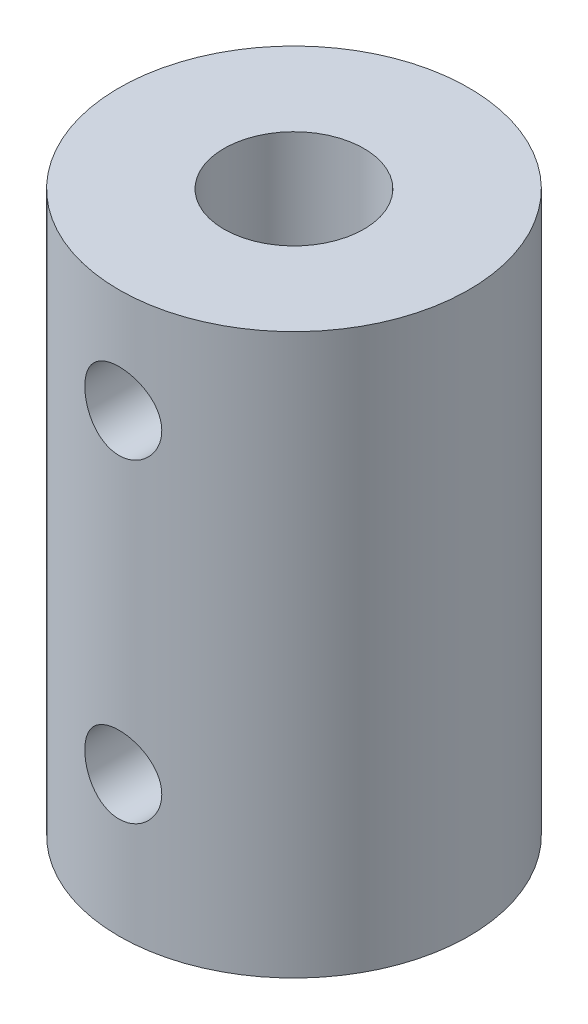
ISO-10303-21;
HEADER;
FILE_DESCRIPTION(('STEP AP214'),'2;1');
FILE_NAME('part.step','',(''),(''),'','','');
FILE_SCHEMA(('AUTOMOTIVE_DESIGN { 1 0 10303 214 1 1 1 1 }'));
ENDSEC;
DATA;
#1=APPLICATION_CONTEXT('core data for automotive mechanical design processes');
#2=APPLICATION_PROTOCOL_DEFINITION('international standard','automotive_design',2000,#1);
#3=PRODUCT_CONTEXT('',#1,'mechanical');
#4=PRODUCT('Part','Part','',(#3));
#5=PRODUCT_RELATED_PRODUCT_CATEGORY('part','',(#4));
#6=PRODUCT_DEFINITION_FORMATION('','',#4);
#7=PRODUCT_DEFINITION_CONTEXT('part definition',#1,'design');
#8=PRODUCT_DEFINITION('design','',#6,#7);
#9=PRODUCT_DEFINITION_SHAPE('','',#8);
#10=(LENGTH_UNIT() NAMED_UNIT(*) SI_UNIT(.MILLI.,.METRE.));
#11=(NAMED_UNIT(*) PLANE_ANGLE_UNIT() SI_UNIT($,.RADIAN.));
#12=(NAMED_UNIT(*) SI_UNIT($,.STERADIAN.) SOLID_ANGLE_UNIT());
#13=UNCERTAINTY_MEASURE_WITH_UNIT(LENGTH_MEASURE(1.E-05),#10,'distance_accuracy_value','');
#14=(GEOMETRIC_REPRESENTATION_CONTEXT(3) GLOBAL_UNCERTAINTY_ASSIGNED_CONTEXT((#13)) GLOBAL_UNIT_ASSIGNED_CONTEXT((#10,
#11,#12)) REPRESENTATION_CONTEXT('',''));
#15=CARTESIAN_POINT('',(0.,0.,0.));
#16=DIRECTION('',(0.,0.,1.));
#17=DIRECTION('',(1.,0.,0.));
#18=AXIS2_PLACEMENT_3D('',#15,#16,#17);
#19=CARTESIAN_POINT('',(0.,-24.,0.));
#20=DIRECTION('',(0.,1.,0.));
#21=DIRECTION('',(0.,0.,1.));
#22=AXIS2_PLACEMENT_3D('',#19,#20,#21);
#23=CYLINDRICAL_SURFACE('',#22,7.5);
#24=CARTESIAN_POINT('',(0.,-6.14999999999999,7.5));
#25=CARTESIAN_POINT('',(0.0914999393408011,-6.14999689388329,7.49999831424106));
#26=CARTESIAN_POINT('',(0.183037296855732,-6.14236318106865,7.49830854961464));
#27=CARTESIAN_POINT('',(0.363511023320149,-6.11206225940867,7.49173097533343));
#28=CARTESIAN_POINT('',(0.452445501715037,-6.08938439323356,7.48684089859969));
#29=CARTESIAN_POINT('',(0.625079242768202,-6.0297405539692,7.47440705823353));
#30=CARTESIAN_POINT('',(0.708783898837724,-5.99278959273429,7.46686608345357));
#31=CARTESIAN_POINT('',(0.868802700314479,-5.90569630891618,7.4499439147352));
#32=CARTESIAN_POINT('',(0.945117019602317,-5.85555429679658,7.44056276410836));
#33=CARTESIAN_POINT('',(1.08942970934261,-5.74264148918915,7.42081741826453));
#34=CARTESIAN_POINT('',(1.15729102940931,-5.67969766887048,7.41044091267737));
#35=CARTESIAN_POINT('',(1.28158292851941,-5.54333940178754,7.38996090019822));
#36=CARTESIAN_POINT('',(1.33801247885255,-5.46992401373074,7.3798574179456));
#37=CARTESIAN_POINT('',(1.43844520787671,-5.31369134292981,7.36094592663126));
#38=CARTESIAN_POINT('',(1.48230220287272,-5.2307780079661,7.35215368644803));
#39=CARTESIAN_POINT('',(1.55540709540188,-5.0585327458251,7.33703697303094));
#40=CARTESIAN_POINT('',(1.58465676165372,-4.96920159724356,7.33071220104563));
#41=CARTESIAN_POINT('',(1.62726320761459,-4.78814395939664,7.3213719537811));
#42=CARTESIAN_POINT('',(1.64086278535652,-4.69647726630274,7.31830597985859));
#43=CARTESIAN_POINT('',(1.65253801366901,-4.51211606415167,7.31567882302511));
#44=CARTESIAN_POINT('',(1.6506155954628,-4.41942168439077,7.31611720410754));
#45=CARTESIAN_POINT('',(1.6314967280213,-4.23744348167057,7.32040352024315));
#46=CARTESIAN_POINT('',(1.61458260643201,-4.14812828725854,7.32418842940723));
#47=CARTESIAN_POINT('',(1.5664078726783,-3.97363508632754,7.33464165989446));
#48=CARTESIAN_POINT('',(1.53514644719315,-3.88845731465377,7.34131014468067));
#49=CARTESIAN_POINT('',(1.45890598688934,-3.72386456484734,7.35684109933612));
#50=CARTESIAN_POINT('',(1.41381862824297,-3.64450145530904,7.36572078647476));
#51=CARTESIAN_POINT('',(1.3112823169619,-3.49436318177397,7.3846631014116));
#52=CARTESIAN_POINT('',(1.25383166066753,-3.42358920346177,7.39472589215443));
#53=CARTESIAN_POINT('',(1.12670629880249,-3.29101303710661,7.41517081765931));
#54=CARTESIAN_POINT('',(1.05679158832993,-3.22944109133507,7.42555512168707));
#55=CARTESIAN_POINT('',(0.907510905058955,-3.11885837608795,7.44527255252899));
#56=CARTESIAN_POINT('',(0.82814475719804,-3.06984783933175,7.45460565986633));
#57=CARTESIAN_POINT('',(0.661931267895289,-2.98572123553566,7.4711999610659));
#58=CARTESIAN_POINT('',(0.575068033653585,-2.95063561420552,7.47845660535503));
#59=CARTESIAN_POINT('',(0.396483640858848,-2.89562258522819,7.49004657125319));
#60=CARTESIAN_POINT('',(0.304763199289835,-2.87569294700434,7.49438032302729));
#61=CARTESIAN_POINT('',(0.121042700683247,-2.85189313774669,7.49957488574714));
#62=CARTESIAN_POINT('',(0.0290852501339717,-2.84770849163739,7.50050369388944));
#63=CARTESIAN_POINT('',(-0.154214783533879,-2.85466469502872,7.49897438369855));
#64=CARTESIAN_POINT('',(-0.245557408436373,-2.8658044922846,7.49651649791089));
#65=CARTESIAN_POINT('',(-0.423991007748931,-2.90283265132216,7.48853291011624));
#66=CARTESIAN_POINT('',(-0.511117938303425,-2.92855581582791,7.48304158779087));
#67=CARTESIAN_POINT('',(-0.679820246095632,-2.99383695756339,7.46960587824172));
#68=CARTESIAN_POINT('',(-0.761395145868541,-3.0333961228733,7.46166128036508));
#69=CARTESIAN_POINT('',(-0.917976261781451,-3.12587978321852,7.44403270371493));
#70=CARTESIAN_POINT('',(-0.992870859505148,-3.1789886922759,7.43432530594193));
#71=CARTESIAN_POINT('',(-1.13279771208182,-3.29682171018652,7.41429527403409));
#72=CARTESIAN_POINT('',(-1.19782866797858,-3.36154734641593,7.40397255911623));
#73=CARTESIAN_POINT('',(-1.3174275998863,-3.50222027859977,7.38364007713336));
#74=CARTESIAN_POINT('',(-1.37177769648958,-3.5783544312955,7.373639743821));
#75=CARTESIAN_POINT('',(-1.46692164784539,-3.73885442521818,7.35530407569124));
#76=CARTESIAN_POINT('',(-1.50771609134851,-3.82321990873516,7.34696866856884));
#77=CARTESIAN_POINT('',(-1.57431369753846,-3.99733416930289,7.33298679212086));
#78=CARTESIAN_POINT('',(-1.60020149826091,-4.08704929627586,7.32732517503717));
#79=CARTESIAN_POINT('',(-1.63649815552641,-4.26969698070692,7.31930499643681));
#80=CARTESIAN_POINT('',(-1.64690952060538,-4.3626290142455,7.3169458996267));
#81=CARTESIAN_POINT('',(-1.65185003885159,-4.5468749692852,7.31583187657225));
#82=CARTESIAN_POINT('',(-1.64672474541726,-4.63817931994234,7.3169985317166));
#83=CARTESIAN_POINT('',(-1.62151064971411,-4.81858911375489,7.32262705863688));
#84=CARTESIAN_POINT('',(-1.60142202805462,-4.90769458343767,7.32708889063959));
#85=CARTESIAN_POINT('',(-1.54701934318005,-5.08089887364454,7.33876659051329));
#86=CARTESIAN_POINT('',(-1.51275612845809,-5.16501437374034,7.34597260690617));
#87=CARTESIAN_POINT('',(-1.43102033898959,-5.32635416226081,7.36233049430586));
#88=CARTESIAN_POINT('',(-1.38354636957811,-5.40357772196298,7.37148257073497));
#89=CARTESIAN_POINT('',(-1.27559296460682,-5.55064370885943,7.3909352154142));
#90=CARTESIAN_POINT('',(-1.21486750796967,-5.62030297965252,7.40125543681466));
#91=CARTESIAN_POINT('',(-1.08263275210778,-5.7485559345428,7.42175007997792));
#92=CARTESIAN_POINT('',(-1.01112096165039,-5.80714705525867,7.43192446746263));
#93=CARTESIAN_POINT('',(-0.858209468643986,-5.91233915166255,7.45113988726204));
#94=CARTESIAN_POINT('',(-0.776692042971303,-5.95877221861649,7.46016424553825));
#95=CARTESIAN_POINT('',(-0.606827789468277,-6.03720389832133,7.47589523887679));
#96=CARTESIAN_POINT('',(-0.518486730197528,-6.06921455037322,7.48260380597825));
#97=CARTESIAN_POINT('',(-0.358388456603651,-6.11222376891093,7.49175811514749));
#98=CARTESIAN_POINT('',(-0.287493809384324,-6.12636269380082,7.4948296001288));
#99=CARTESIAN_POINT('',(-0.144407171386655,-6.14525182243697,7.49895116200565));
#100=CARTESIAN_POINT('',(-0.0722152395237916,-6.15000245146568,7.5000013304652));
#101=CARTESIAN_POINT('',(0.,-6.14999999999999,7.5));
#102=B_SPLINE_CURVE_WITH_KNOTS('',3,(#24,#25,#26,#27,#28,#29,#30,#31,#32,#33,#34,#35,#36,#37,
#38,#39,#40,#41,#42,#43,#44,#45,#46,#47,#48,#49,#50,#51,#52,#53,#54,#55,#56,#57,#58,#59,#60,#61,
#62,#63,#64,#65,#66,#67,#68,#69,#70,#71,#72,#73,#74,#75,#76,#77,#78,#79,#80,#81,#82,#83,#84,#85,
#86,#87,#88,#89,#90,#91,#92,#93,#94,#95,#96,#97,#98,#99,#100,#101),.UNSPECIFIED.,.T.,.F.,(4,2,2,
2,2,2,2,2,2,2,2,2,2,2,2,2,2,2,2,2,2,2,2,2,2,2,2,2,2,2,2,2,2,2,2,2,2,2,4),(0.,0.274235469748509,
0.548665416592522,0.822807511778603,1.09694315535338,1.37506480293447,1.65321146673233,
1.93447194708654,2.21569836294015,2.49250033112996,2.76926786056845,3.04093142111883,
3.31261038365022,3.58647477653389,3.86037693206285,4.14027337309168,4.42017499925701,
4.70068528026744,4.98115426927861,5.25599076583744,5.53080839183635,5.80257342230781,
6.07436179463611,6.35006739343502,6.62580926880842,6.90669641720308,7.1875713644818,
7.46683540152297,7.74605416843228,8.01910869065847,8.29215991713438,8.56424000622431,
8.83634882982829,9.11402013989234,9.39175567994315,9.67314563039329,9.95430024968245,
10.1707471396203,10.3871842244587),.UNSPECIFIED.);
#103=CARTESIAN_POINT('',(0.,-6.14999999999999,7.5));
#104=VERTEX_POINT('',#103);
#105=EDGE_CURVE('E108',#104,#104,#102,.T.);
#106=ORIENTED_EDGE('',*,*,#105,.F.);
#107=EDGE_LOOP('',(#106));
#108=FACE_BOUND('',#107,.T.);
#109=CARTESIAN_POINT('',(0.,-19.65,7.5));
#110=CARTESIAN_POINT('',(0.0914999393408012,-19.6499968938833,7.49999831424106));
#111=CARTESIAN_POINT('',(0.183037296855732,-19.6423631810687,7.49830854961464));
#112=CARTESIAN_POINT('',(0.363511023320149,-19.6120622594087,7.49173097533343));
#113=CARTESIAN_POINT('',(0.452445501715037,-19.5893843932336,7.48684089859969));
#114=CARTESIAN_POINT('',(0.625079242768202,-19.5297405539692,7.47440705823353));
#115=CARTESIAN_POINT('',(0.708783898837724,-19.4927895927343,7.46686608345357));
#116=CARTESIAN_POINT('',(0.868802700314479,-19.4056963089162,7.4499439147352));
#117=CARTESIAN_POINT('',(0.945117019602317,-19.3555542967966,7.44056276410836));
#118=CARTESIAN_POINT('',(1.08942970934261,-19.2426414891892,7.42081741826453));
#119=CARTESIAN_POINT('',(1.15729102940931,-19.1796976688705,7.41044091267737));
#120=CARTESIAN_POINT('',(1.28158292851941,-19.0433394017875,7.38996090019822));
#121=CARTESIAN_POINT('',(1.33801247885254,-18.9699240137307,7.3798574179456));
#122=CARTESIAN_POINT('',(1.43844520787671,-18.8136913429298,7.36094592663126));
#123=CARTESIAN_POINT('',(1.48230220287272,-18.7307780079661,7.35215368644803));
#124=CARTESIAN_POINT('',(1.55540709540188,-18.5585327458251,7.33703697303094));
#125=CARTESIAN_POINT('',(1.58465676165372,-18.4692015972436,7.33071220104563));
#126=CARTESIAN_POINT('',(1.62726320761459,-18.2881439593966,7.3213719537811));
#127=CARTESIAN_POINT('',(1.64086278535652,-18.1964772663028,7.31830597985859));
#128=CARTESIAN_POINT('',(1.65253801366901,-18.0121160641517,7.31567882302511));
#129=CARTESIAN_POINT('',(1.6506155954628,-17.9194216843908,7.31611720410754));
#130=CARTESIAN_POINT('',(1.6314967280213,-17.7374434816706,7.32040352024315));
#131=CARTESIAN_POINT('',(1.61458260643201,-17.6481282872585,7.32418842940723));
#132=CARTESIAN_POINT('',(1.5664078726783,-17.4736350863276,7.33464165989446));
#133=CARTESIAN_POINT('',(1.53514644719315,-17.3884573146538,7.34131014468067));
#134=CARTESIAN_POINT('',(1.45890598688934,-17.2238645648473,7.35684109933612));
#135=CARTESIAN_POINT('',(1.41381862824297,-17.144501455309,7.36572078647476));
#136=CARTESIAN_POINT('',(1.3112823169619,-16.994363181774,7.3846631014116));
#137=CARTESIAN_POINT('',(1.25383166066753,-16.9235892034618,7.39472589215443));
#138=CARTESIAN_POINT('',(1.12670629880249,-16.7910130371066,7.41517081765931));
#139=CARTESIAN_POINT('',(1.05679158832993,-16.7294410913351,7.42555512168707));
#140=CARTESIAN_POINT('',(0.907510905058958,-16.618858376088,7.44527255252899));
#141=CARTESIAN_POINT('',(0.828144757198042,-16.5698478393318,7.45460565986633));
#142=CARTESIAN_POINT('',(0.661931267895291,-16.4857212355357,7.4711999610659));
#143=CARTESIAN_POINT('',(0.575068033653587,-16.4506356142055,7.47845660535503));
#144=CARTESIAN_POINT('',(0.396483640858849,-16.3956225852282,7.49004657125319));
#145=CARTESIAN_POINT('',(0.304763199289835,-16.3756929470043,7.49438032302729));
#146=CARTESIAN_POINT('',(0.121042700683246,-16.3518931377467,7.49957488574714));
#147=CARTESIAN_POINT('',(0.0290852501339711,-16.3477084916374,7.50050369388944));
#148=CARTESIAN_POINT('',(-0.154214783533879,-16.3546646950287,7.49897438369855));
#149=CARTESIAN_POINT('',(-0.245557408436374,-16.3658044922846,7.49651649791089));
#150=CARTESIAN_POINT('',(-0.423991007748931,-16.4028326513222,7.48853291011624));
#151=CARTESIAN_POINT('',(-0.511117938303425,-16.4285558158279,7.48304158779087));
#152=CARTESIAN_POINT('',(-0.679820246095632,-16.4938369575634,7.46960587824172));
#153=CARTESIAN_POINT('',(-0.761395145868541,-16.5333961228733,7.46166128036508));
#154=CARTESIAN_POINT('',(-0.917976261781452,-16.6258797832185,7.44403270371493));
#155=CARTESIAN_POINT('',(-0.99287085950515,-16.6789886922759,7.43432530594193));
#156=CARTESIAN_POINT('',(-1.13279771208182,-16.7968217101865,7.41429527403409));
#157=CARTESIAN_POINT('',(-1.19782866797858,-16.8615473464159,7.40397255911623));
#158=CARTESIAN_POINT('',(-1.3174275998863,-17.0022202785998,7.38364007713336));
#159=CARTESIAN_POINT('',(-1.37177769648958,-17.0783544312955,7.373639743821));
#160=CARTESIAN_POINT('',(-1.46692164784539,-17.2388544252182,7.35530407569124));
#161=CARTESIAN_POINT('',(-1.50771609134851,-17.3232199087352,7.34696866856884));
#162=CARTESIAN_POINT('',(-1.57431369753846,-17.4973341693029,7.33298679212086));
#163=CARTESIAN_POINT('',(-1.60020149826091,-17.5870492962759,7.32732517503717));
#164=CARTESIAN_POINT('',(-1.63649815552641,-17.7696969807069,7.31930499643681));
#165=CARTESIAN_POINT('',(-1.64690952060538,-17.8626290142455,7.3169458996267));
#166=CARTESIAN_POINT('',(-1.65185003885159,-18.0468749692852,7.31583187657225));
#167=CARTESIAN_POINT('',(-1.64672474541726,-18.1381793199423,7.3169985317166));
#168=CARTESIAN_POINT('',(-1.62151064971411,-18.3185891137549,7.32262705863688));
#169=CARTESIAN_POINT('',(-1.60142202805462,-18.4076945834377,7.32708889063959));
#170=CARTESIAN_POINT('',(-1.54701934318005,-18.5808988736445,7.33876659051329));
#171=CARTESIAN_POINT('',(-1.51275612845809,-18.6650143737403,7.34597260690617));
#172=CARTESIAN_POINT('',(-1.43102033898959,-18.8263541622608,7.36233049430586));
#173=CARTESIAN_POINT('',(-1.38354636957811,-18.903577721963,7.37148257073497));
#174=CARTESIAN_POINT('',(-1.27559296460683,-19.0506437088594,7.3909352154142));
#175=CARTESIAN_POINT('',(-1.21486750796967,-19.1203029796525,7.40125543681466));
#176=CARTESIAN_POINT('',(-1.08263275210779,-19.2485559345428,7.42175007997792));
#177=CARTESIAN_POINT('',(-1.01112096165039,-19.3071470552587,7.43192446746263));
#178=CARTESIAN_POINT('',(-0.858209468643986,-19.4123391516626,7.45113988726204));
#179=CARTESIAN_POINT('',(-0.776692042971304,-19.4587722186165,7.46016424553825));
#180=CARTESIAN_POINT('',(-0.606827789468277,-19.5372038983213,7.47589523887679));
#181=CARTESIAN_POINT('',(-0.518486730197529,-19.5692145503732,7.48260380597825));
#182=CARTESIAN_POINT('',(-0.358388456603652,-19.6122237689109,7.49175811514749));
#183=CARTESIAN_POINT('',(-0.287493809384325,-19.6263626938008,7.4948296001288));
#184=CARTESIAN_POINT('',(-0.144407171386655,-19.645251822437,7.49895116200565));
#185=CARTESIAN_POINT('',(-0.0722152395237918,-19.6500024514657,7.5000013304652));
#186=CARTESIAN_POINT('',(0.,-19.65,7.5));
#187=B_SPLINE_CURVE_WITH_KNOTS('',3,(#109,#110,#111,#112,#113,#114,#115,#116,#117,#118,#119,
#120,#121,#122,#123,#124,#125,#126,#127,#128,#129,#130,#131,#132,#133,#134,#135,#136,#137,#138,
#139,#140,#141,#142,#143,#144,#145,#146,#147,#148,#149,#150,#151,#152,#153,#154,#155,#156,#157,
#158,#159,#160,#161,#162,#163,#164,#165,#166,#167,#168,#169,#170,#171,#172,#173,#174,#175,#176,
#177,#178,#179,#180,#181,#182,#183,#184,#185,#186),.UNSPECIFIED.,.T.,.F.,(4,2,2,2,2,2,2,2,2,2,2,
2,2,2,2,2,2,2,2,2,2,2,2,2,2,2,2,2,2,2,2,2,2,2,2,2,2,2,4),(0.,0.274235469748509,
0.548665416592522,0.822807511778603,1.09694315535338,1.37506480293447,1.65321146673233,
1.93447194708654,2.21569836294015,2.49250033112995,2.76926786056844,3.04093142111882,
3.31261038365022,3.58647477653389,3.86037693206285,4.14027337309167,4.42017499925701,
4.70068528026744,4.98115426927861,5.25599076583745,5.53080839183635,5.80257342230781,
6.07436179463612,6.35006739343503,6.62580926880842,6.90669641720308,7.1875713644818,
7.46683540152297,7.74605416843228,8.01910869065847,8.29215991713439,8.56424000622432,
8.83634882982829,9.11402013989234,9.39175567994315,9.67314563039329,9.95430024968245,
10.1707471396203,10.3871842244587),.UNSPECIFIED.);
#188=CARTESIAN_POINT('',(0.,-19.65,7.5));
#189=VERTEX_POINT('',#188);
#190=EDGE_CURVE('E51',#189,#189,#187,.T.);
#191=ORIENTED_EDGE('',*,*,#190,.F.);
#192=EDGE_LOOP('',(#191));
#193=FACE_BOUND('',#192,.T.);
#194=CARTESIAN_POINT('',(0.,-24.,0.));
#195=DIRECTION('',(0.,1.,0.));
#196=DIRECTION('',(0.,0.,1.));
#197=AXIS2_PLACEMENT_3D('',#194,#195,#196);
#198=CIRCLE('',#197,7.5);
#199=CARTESIAN_POINT('',(0.,-24.,7.5));
#200=VERTEX_POINT('',#199);
#201=EDGE_CURVE('E10',#200,#200,#198,.T.);
#202=ORIENTED_EDGE('',*,*,#201,.T.);
#203=EDGE_LOOP('',(#202));
#204=FACE_BOUND('',#203,.T.);
#205=CARTESIAN_POINT('',(0.,0.,0.));
#206=DIRECTION('',(0.,1.,0.));
#207=DIRECTION('',(0.,0.,1.));
#208=AXIS2_PLACEMENT_3D('',#205,#206,#207);
#209=CIRCLE('',#208,7.5);
#210=CARTESIAN_POINT('',(0.,0.,7.5));
#211=VERTEX_POINT('',#210);
#212=EDGE_CURVE('E33',#211,#211,#209,.T.);
#213=ORIENTED_EDGE('',*,*,#212,.F.);
#214=EDGE_LOOP('',(#213));
#215=FACE_BOUND('',#214,.T.);
#216=ADVANCED_FACE('F29',(#108,#193,#204,#215),#23,.T.);
#217=CARTESIAN_POINT('',(0.,-24.,0.));
#218=DIRECTION('',(0.,1.,0.));
#219=DIRECTION('',(0.,0.,1.));
#220=AXIS2_PLACEMENT_3D('',#217,#218,#219);
#221=PLANE('',#220);
#222=CARTESIAN_POINT('',(0.,-24.,0.));
#223=DIRECTION('',(0.,-1.,0.));
#224=DIRECTION('',(0.,0.,-1.));
#225=AXIS2_PLACEMENT_3D('',#222,#223,#224);
#226=CIRCLE('',#225,4.);
#227=CARTESIAN_POINT('',(0.,-24.,-4.));
#228=VERTEX_POINT('',#227);
#229=EDGE_CURVE('E48',#228,#228,#226,.T.);
#230=ORIENTED_EDGE('',*,*,#229,.F.);
#231=EDGE_LOOP('',(#230));
#232=FACE_BOUND('',#231,.T.);
#233=ORIENTED_EDGE('',*,*,#201,.F.);
#234=EDGE_LOOP('',(#233));
#235=FACE_BOUND('',#234,.T.);
#236=ADVANCED_FACE('F92',(#232,#235),#221,.F.);
#237=CARTESIAN_POINT('',(0.,0.,0.));
#238=DIRECTION('',(0.,1.,0.));
#239=DIRECTION('',(0.,0.,1.));
#240=AXIS2_PLACEMENT_3D('',#237,#238,#239);
#241=PLANE('',#240);
#242=CARTESIAN_POINT('',(0.,0.,0.));
#243=DIRECTION('',(0.,1.,0.));
#244=DIRECTION('',(0.,0.,1.));
#245=AXIS2_PLACEMENT_3D('',#242,#243,#244);
#246=CIRCLE('',#245,3.);
#247=CARTESIAN_POINT('',(0.,0.,3.));
#248=VERTEX_POINT('',#247);
#249=EDGE_CURVE('E42',#248,#248,#246,.T.);
#250=ORIENTED_EDGE('',*,*,#249,.F.);
#251=EDGE_LOOP('',(#250));
#252=FACE_BOUND('',#251,.T.);
#253=ORIENTED_EDGE('',*,*,#212,.T.);
#254=EDGE_LOOP('',(#253));
#255=FACE_BOUND('',#254,.T.);
#256=ADVANCED_FACE('F90',(#252,#255),#241,.T.);
#257=CARTESIAN_POINT('',(0.,-8.,0.));
#258=DIRECTION('',(0.,1.,0.));
#259=DIRECTION('',(0.,0.,1.));
#260=AXIS2_PLACEMENT_3D('',#257,#258,#259);
#261=CYLINDRICAL_SURFACE('',#260,3.);
#262=CARTESIAN_POINT('',(0.,-6.14999999999999,3.));
#263=CARTESIAN_POINT('',(0.0856699475452993,-6.14999461662168,2.99999513886583));
#264=CARTESIAN_POINT('',(0.171409071205646,-6.14328935440902,2.99629302255545));
#265=CARTESIAN_POINT('',(0.340286051726046,-6.11679778476963,2.9818478399119));
#266=CARTESIAN_POINT('',(0.423420195379859,-6.09699362165196,2.97109516282085));
#267=CARTESIAN_POINT('',(0.584401577928636,-6.04534553567832,2.9436571869529));
#268=CARTESIAN_POINT('',(0.662269062667417,-6.01355122137033,2.9269963495649));
#269=CARTESIAN_POINT('',(0.811408240635761,-5.93912133182605,2.8892116252981));
#270=CARTESIAN_POINT('',(0.882679651896671,-5.89648529341992,2.86808754775153));
#271=CARTESIAN_POINT('',(1.02211619357275,-5.7982846668754,2.82153252993505));
#272=CARTESIAN_POINT('',(1.0897303734279,-5.74203247555585,2.79590528013302));
#273=CARTESIAN_POINT('',(1.21508634233516,-5.61970839153989,2.74375354722835));
#274=CARTESIAN_POINT('',(1.27281890234559,-5.55362742563047,2.71722825277821));
#275=CARTESIAN_POINT('',(1.38251917690996,-5.40577401407733,2.66321895829991));
#276=CARTESIAN_POINT('',(1.43335857713386,-5.32309703851527,2.63589796579201));
#277=CARTESIAN_POINT('',(1.52021547735939,-5.14877263436736,2.58678336476684));
#278=CARTESIAN_POINT('',(1.5562446891168,-5.05713236514275,2.56498539395023));
#279=CARTESIAN_POINT('',(1.60989890926138,-4.8732305515727,2.53163475086558));
#280=CARTESIAN_POINT('',(1.62854263347078,-4.78137384654716,2.51952192354843));
#281=CARTESIAN_POINT('',(1.64991120631134,-4.59511055144333,2.5055890563389));
#282=CARTESIAN_POINT('',(1.65265887915296,-4.50070781297601,2.50375425894472));
#283=CARTESIAN_POINT('',(1.64290000078863,-4.32757164325043,2.51015646726158));
#284=CARTESIAN_POINT('',(1.63265157443424,-4.24864024150067,2.51690299364892));
#285=CARTESIAN_POINT('',(1.60118639026893,-4.09387058009675,2.53703527550373));
#286=CARTESIAN_POINT('',(1.57996463656909,-4.0180337463059,2.55042405491467));
#287=CARTESIAN_POINT('',(1.52687641342514,-3.8695176799991,2.58256130946142));
#288=CARTESIAN_POINT('',(1.49479033069661,-3.7969417622077,2.60141910516922));
#289=CARTESIAN_POINT('',(1.42107429999087,-3.65782897940317,2.64240902469132));
#290=CARTESIAN_POINT('',(1.3794402325366,-3.59129473841807,2.66454256035722));
#291=CARTESIAN_POINT('',(1.28018349411555,-3.45510521641989,2.71379040847906));
#292=CARTESIAN_POINT('',(1.22107458392543,-3.38661394811562,2.74113957142577));
#293=CARTESIAN_POINT('',(1.09224532196501,-3.25997341934865,2.79497377887706));
#294=CARTESIAN_POINT('',(1.02251777065963,-3.20183123410758,2.82145822218593));
#295=CARTESIAN_POINT('',(0.86860504180093,-3.09378517331663,2.87272134052732));
#296=CARTESIAN_POINT('',(0.783763861453037,-3.04469535937108,2.89726648156192));
#297=CARTESIAN_POINT('',(0.605352377645228,-2.96191924656254,2.93971528365153));
#298=CARTESIAN_POINT('',(0.511790381195989,-2.92821846583331,2.95762518579738));
#299=CARTESIAN_POINT('',(0.327907037980974,-2.88038778956177,2.98333345624201));
#300=CARTESIAN_POINT('',(0.238095480523285,-2.86472744848249,2.99191822782612));
#301=CARTESIAN_POINT('',(0.0567325334425106,-2.84846917129307,3.00083376662002));
#302=CARTESIAN_POINT('',(-0.034817706934437,-2.84786161003821,3.00116980828416));
#303=CARTESIAN_POINT('',(-0.207487375150859,-2.86103451330555,2.99394177831786));
#304=CARTESIAN_POINT('',(-0.288751776237441,-2.8734146012818,2.98714659587173));
#305=CARTESIAN_POINT('',(-0.447838849624849,-2.90984259733265,2.96746793830126));
#306=CARTESIAN_POINT('',(-0.525661172937911,-2.93389168556647,2.95458384737082));
#307=CARTESIAN_POINT('',(-0.677753407865904,-2.99335761595169,2.92349378037743));
#308=CARTESIAN_POINT('',(-0.751904240945377,-3.02901769554693,2.90517475144826));
#309=CARTESIAN_POINT('',(-0.893363199749703,-3.11037134629974,2.86484215103297));
#310=CARTESIAN_POINT('',(-0.960668811424107,-3.15606858448362,2.8428272299655));
#311=CARTESIAN_POINT('',(-1.09455456288909,-3.26204471413837,2.79420331593949));
#312=CARTESIAN_POINT('',(-1.16021004375817,-3.323383283659,2.76735592347542));
#313=CARTESIAN_POINT('',(-1.28079913012788,-3.4559244296775,2.71365440736755));
#314=CARTESIAN_POINT('',(-1.33572155748716,-3.52713715928238,2.6868003055646));
#315=CARTESIAN_POINT('',(-1.43747254066661,-3.68416419340714,2.63385875511374));
#316=CARTESIAN_POINT('',(-1.48334076829298,-3.77068307687538,2.60799295737884));
#317=CARTESIAN_POINT('',(-1.55942876653783,-3.95199407970866,2.56323063992908));
#318=CARTESIAN_POINT('',(-1.58967133039467,-4.04677391139993,2.54432398053561));
#319=CARTESIAN_POINT('',(-1.6306246255404,-4.23226237758553,2.51825420457376));
#320=CARTESIAN_POINT('',(-1.64294477567078,-4.3224747805395,2.51013022153209));
#321=CARTESIAN_POINT('',(-1.65249034912289,-4.50401046928805,2.50386093509844));
#322=CARTESIAN_POINT('',(-1.64972872967261,-4.59533273427257,2.50570706604925));
#323=CARTESIAN_POINT('',(-1.63075691736924,-4.76321952155551,2.51807870697286));
#324=CARTESIAN_POINT('',(-1.61642825416934,-4.84010097353313,2.52738874118224));
#325=CARTESIAN_POINT('',(-1.57741079979875,-4.99019541895998,2.55192145753237));
#326=CARTESIAN_POINT('',(-1.55271775279778,-5.06340689160001,2.56714656833463));
#327=CARTESIAN_POINT('',(-1.49205611796199,-5.20913964629297,2.60289749299614));
#328=CARTESIAN_POINT('',(-1.45548954002738,-5.2813439958992,2.62369085726805));
#329=CARTESIAN_POINT('',(-1.37268509596928,-5.41907602150034,2.66794671801683));
#330=CARTESIAN_POINT('',(-1.32644209751912,-5.48460012678668,2.69141062791392));
#331=CARTESIAN_POINT('',(-1.21715006880684,-5.61784973955533,2.74276036037727));
#332=CARTESIAN_POINT('',(-1.15260264369496,-5.68430823518328,2.77076245736401));
#333=CARTESIAN_POINT('',(-1.01279351012943,-5.80588442742214,2.82486614857147));
#334=CARTESIAN_POINT('',(-0.937524174112377,-5.860993981549,2.85096636964492));
#335=CARTESIAN_POINT('',(-0.774887264813818,-5.95993803396585,2.89948189270181));
#336=CARTESIAN_POINT('',(-0.687189892415581,-6.00331356440636,2.92173740350452));
#337=CARTESIAN_POINT('',(-0.504223640414887,-6.07410971433074,2.95878417900051));
#338=CARTESIAN_POINT('',(-0.408974898948844,-6.10157124777072,2.97359457153256));
#339=CARTESIAN_POINT('',(-0.260510618519067,-6.13014205801229,2.98911434756595));
#340=CARTESIAN_POINT('',(-0.208783056433917,-6.13757243201225,2.99318008334623));
#341=CARTESIAN_POINT('',(-0.10471227339959,-6.14750301282088,2.99862437594614));
#342=CARTESIAN_POINT('',(-0.052369061348573,-6.15000329079773,3.00000297155585));
#343=CARTESIAN_POINT('',(0.,-6.14999999999999,3.));
#344=B_SPLINE_CURVE_WITH_KNOTS('',3,(#262,#263,#264,#265,#266,#267,#268,#269,#270,#271,#272,
#273,#274,#275,#276,#277,#278,#279,#280,#281,#282,#283,#284,#285,#286,#287,#288,#289,#290,#291,
#292,#293,#294,#295,#296,#297,#298,#299,#300,#301,#302,#303,#304,#305,#306,#307,#308,#309,#310,
#311,#312,#313,#314,#315,#316,#317,#318,#319,#320,#321,#322,#323,#324,#325,#326,#327,#328,#329,
#330,#331,#332,#333,#334,#335,#336,#337,#338,#339,#340,#341,#342,#343),.UNSPECIFIED.,.T.,.F.,(4,
2,2,2,2,2,2,2,2,2,2,2,2,2,2,2,2,2,2,2,2,2,2,2,2,2,2,2,2,2,2,2,2,2,2,2,2,2,2,2,4),(0.,
0.256799016537926,0.513948810602822,0.770046131883807,1.02615439574975,1.29988051794781,
1.57386091081863,1.87483382859251,2.1755682798451,2.45730761481343,2.73864231615319,
2.97715628850377,3.21577894619803,3.4595457638622,3.70341795322453,3.9857698226592,
4.26831398861795,4.56980790280869,4.87101750814849,5.14417314031285,5.41715410504552,
5.66345591892141,5.90978264803876,6.16164305576707,6.41359563296032,6.69375293580819,
6.97420047673713,7.2764362913265,7.57822997932255,7.85076329691245,8.1230625093144,
8.35830132419626,8.59363682764363,8.84338665158083,9.09326927891539,9.38234984684166,
9.67163710326647,9.97098879991465,10.2695674268337,10.4265480013941,10.5835263098519),.UNSPECIFIED.);
#345=CARTESIAN_POINT('',(0.,-6.14999999999999,3.));
#346=VERTEX_POINT('',#345);
#347=EDGE_CURVE('E115',#346,#346,#344,.T.);
#348=ORIENTED_EDGE('',*,*,#347,.T.);
#349=EDGE_LOOP('',(#348));
#350=FACE_BOUND('',#349,.T.);
#351=CARTESIAN_POINT('',(0.,-8.,0.));
#352=DIRECTION('',(0.,1.,0.));
#353=DIRECTION('',(0.,0.,1.));
#354=AXIS2_PLACEMENT_3D('',#351,#352,#353);
#355=CIRCLE('',#354,3.);
#356=CARTESIAN_POINT('',(0.,-8.,3.));
#357=VERTEX_POINT('',#356);
#358=EDGE_CURVE('E40',#357,#357,#355,.T.);
#359=ORIENTED_EDGE('',*,*,#358,.F.);
#360=EDGE_LOOP('',(#359));
#361=FACE_BOUND('',#360,.T.);
#362=ORIENTED_EDGE('',*,*,#249,.T.);
#363=EDGE_LOOP('',(#362));
#364=FACE_BOUND('',#363,.T.);
#365=ADVANCED_FACE('F86',(#350,#361,#364),#261,.F.);
#366=CARTESIAN_POINT('',(0.,-8.,0.));
#367=DIRECTION('',(0.,1.,0.));
#368=DIRECTION('',(0.,0.,1.));
#369=AXIS2_PLACEMENT_3D('',#366,#367,#368);
#370=PLANE('',#369);
#371=ORIENTED_EDGE('',*,*,#358,.T.);
#372=EDGE_LOOP('',(#371));
#373=FACE_BOUND('',#372,.T.);
#374=ADVANCED_FACE('F82',(#373),#370,.T.);
#375=CARTESIAN_POINT('',(0.,-12.,0.));
#376=DIRECTION('',(0.,-1.,0.));
#377=DIRECTION('',(0.,0.,-1.));
#378=AXIS2_PLACEMENT_3D('',#375,#376,#377);
#379=CYLINDRICAL_SURFACE('',#378,4.);
#380=CARTESIAN_POINT('',(1.64999999999999,-18.,3.64383040220041));
#381=CARTESIAN_POINT('',(1.64999056813102,-17.9119035197743,3.64383945275153));
#382=CARTESIAN_POINT('',(1.64289989177357,-17.8236595680264,3.64707173267573));
#383=CARTESIAN_POINT('',(1.61480845546373,-17.6497129389211,3.65959209124688));
#384=CARTESIAN_POINT('',(1.59376957896339,-17.5640178994024,3.66889676295875));
#385=CARTESIAN_POINT('',(1.53873536249637,-17.3979970618694,3.69231325052126));
#386=CARTESIAN_POINT('',(1.50479212400173,-17.3176511797814,3.70640571161012));
#387=CARTESIAN_POINT('',(1.42506535594206,-17.1638182331658,3.73778230052357));
#388=CARTESIAN_POINT('',(1.37928479159595,-17.090329457216,3.75506562873473));
#389=CARTESIAN_POINT('',(1.27419856290371,-16.9477713121535,3.7920553041855));
#390=CARTESIAN_POINT('',(1.21428518241359,-16.8791707442198,3.81184277704779));
#391=CARTESIAN_POINT('',(1.08391072165482,-16.7526452280912,3.85094363418238));
#392=CARTESIAN_POINT('',(1.01344563996364,-16.6947243485278,3.87025683535296));
#393=CARTESIAN_POINT('',(0.860301943593378,-16.5888286286981,3.90721575035942));
#394=CARTESIAN_POINT('',(0.777232390113587,-16.5413790672938,3.92475616703248));
#395=CARTESIAN_POINT('',(0.603436361875854,-16.4613298546783,3.95520283117798));
#396=CARTESIAN_POINT('',(0.512713242513042,-16.4287237356534,3.96811109652272));
#397=CARTESIAN_POINT('',(0.331105172304396,-16.3809792933438,3.98726403378776));
#398=CARTESIAN_POINT('',(0.24046562518449,-16.3650331520768,3.99381564337609));
#399=CARTESIAN_POINT('',(0.057576355149864,-16.3484533481448,4.0006306156112));
#400=CARTESIAN_POINT('',(-0.034672713770956,-16.347813604678,4.00089647540932));
#401=CARTESIAN_POINT('',(-0.212297380895985,-16.3614364961366,3.99529224160632));
#402=CARTESIAN_POINT('',(-0.297754665400396,-16.3748121837171,3.98978733384658));
#403=CARTESIAN_POINT('',(-0.465085845235278,-16.4145688174478,3.97375926025944));
#404=CARTESIAN_POINT('',(-0.546959476205491,-16.4409507212907,3.96323572489496));
#405=CARTESIAN_POINT('',(-0.706295606817228,-16.5062876617202,3.93798907731603));
#406=CARTESIAN_POINT('',(-0.783671979762467,-16.5454279899249,3.92320447216362));
#407=CARTESIAN_POINT('',(-0.930960489992463,-16.6349912791866,3.89088763760773));
#408=CARTESIAN_POINT('',(-1.00086999453932,-16.6854182005033,3.87335444442337));
#409=CARTESIAN_POINT('',(-1.1363853094704,-16.8001882390286,3.83587133640027));
#410=CARTESIAN_POINT('',(-1.20135746318645,-16.8652534108987,3.8158381454309));
#411=CARTESIAN_POINT('',(-1.31973838423493,-17.0054096663216,3.77653142784555));
#412=CARTESIAN_POINT('',(-1.37314286572201,-17.0805044492633,3.75725818494773));
#413=CARTESIAN_POINT('',(-1.46845339844827,-17.2415984035473,3.72106607156909));
#414=CARTESIAN_POINT('',(-1.50994179309276,-17.3278675716927,3.70424107982558));
#415=CARTESIAN_POINT('',(-1.57754508127095,-17.5070466714059,3.67596385006486));
#416=CARTESIAN_POINT('',(-1.6036707120612,-17.5999519138738,3.66450786071418));
#417=CARTESIAN_POINT('',(-1.63821320355941,-17.783422895185,3.64919091711419));
#418=CARTESIAN_POINT('',(-1.64765569454681,-17.8737583011829,3.64489111171832));
#419=CARTESIAN_POINT('',(-1.65157101672826,-18.0548056296986,3.64311980380968));
#420=CARTESIAN_POINT('',(-1.64604885780401,-18.1455174160593,3.6456460160745));
#421=CARTESIAN_POINT('',(-1.62112710501826,-18.3188010090495,3.65678944366161));
#422=CARTESIAN_POINT('',(-1.60261202118542,-18.4015281796746,3.66501803861665));
#423=CARTESIAN_POINT('',(-1.55339580262014,-18.56263706438,3.68614612916707));
#424=CARTESIAN_POINT('',(-1.52269185697123,-18.6410177713517,3.69904670212357));
#425=CARTESIAN_POINT('',(-1.44853902204984,-18.7948790056956,3.72872477858182));
#426=CARTESIAN_POINT('',(-1.40460979308263,-18.8701001947792,3.74564214050945));
#427=CARTESIAN_POINT('',(-1.30573455409451,-19.0124601694297,3.78124523189864));
#428=CARTESIAN_POINT('',(-1.25078384473683,-19.0795954877351,3.79993171387674));
#429=CARTESIAN_POINT('',(-1.12627542162098,-19.2094296264467,3.83876011670653));
#430=CARTESIAN_POINT('',(-1.05590387126703,-19.2713517370487,3.85889967217623));
#431=CARTESIAN_POINT('',(-0.905297980080099,-19.3826428556621,3.89698114804694));
#432=CARTESIAN_POINT('',(-0.8250630020269,-19.4320110520032,3.91492292631237));
#433=CARTESIAN_POINT('',(-0.656516816883264,-19.5167041342068,3.94668767391886));
#434=CARTESIAN_POINT('',(-0.568191273870488,-19.5520034750027,3.96050313975064));
#435=CARTESIAN_POINT('',(-0.386140833605175,-19.6069916568587,3.98237104121021));
#436=CARTESIAN_POINT('',(-0.292419112817559,-19.6266895829389,3.9904268305481));
#437=CARTESIAN_POINT('',(-0.109187189544835,-19.6487882289205,3.9994889299446));
#438=CARTESIAN_POINT('',(-0.0198303081186345,-19.6522848287419,4.00094173424749));
#439=CARTESIAN_POINT('',(0.158161739195412,-19.6448145656297,3.99786220239438));
#440=CARTESIAN_POINT('',(0.246797024648479,-19.6338501500045,3.99333087896147));
#441=CARTESIAN_POINT('',(0.417705375935875,-19.5985553578644,3.979024148364));
#442=CARTESIAN_POINT('',(0.50009237162785,-19.5746955578854,3.96943363922013));
#443=CARTESIAN_POINT('',(0.659667355734158,-19.51479588512,3.94605480923816));
#444=CARTESIAN_POINT('',(0.736854343148742,-19.4787536752133,3.93226568297163));
#445=CARTESIAN_POINT('',(0.887661133732616,-19.3936954733136,3.90105808483759));
#446=CARTESIAN_POINT('',(0.960964214361148,-19.3441687432271,3.8835042391169));
#447=CARTESIAN_POINT('',(1.09852932170704,-19.23429715321,3.84685709666619));
#448=CARTESIAN_POINT('',(1.1627880603165,-19.1739483769192,3.82776324400832));
#449=CARTESIAN_POINT('',(1.28487769945047,-19.0394124726453,3.78859741195738));
#450=CARTESIAN_POINT('',(1.34199767947156,-18.9645722431151,3.76854475207572));
#451=CARTESIAN_POINT('',(1.44296474677329,-18.8057340243189,3.73105419200534));
#452=CARTESIAN_POINT('',(1.48680449811903,-18.7217310082904,3.7136177396712));
#453=CARTESIAN_POINT('',(1.55944447766651,-18.5472715587301,3.68370387904713));
#454=CARTESIAN_POINT('',(1.58834112875233,-18.4568608919089,3.67119480418034));
#455=CARTESIAN_POINT('',(1.63017263567572,-18.2719528559216,3.65281837075147));
#456=CARTESIAN_POINT('',(1.64316103312974,-18.1774703091231,3.64692873900432));
#457=CARTESIAN_POINT('',(1.64931209329419,-18.0551366863574,3.6441405441978));
#458=CARTESIAN_POINT('',(1.6500029523216,-18.027575567715,3.64382756923723));
#459=CARTESIAN_POINT('',(1.64999999999999,-18.,3.64383040220041));
#460=B_SPLINE_CURVE_WITH_KNOTS('',3,(#380,#381,#382,#383,#384,#385,#386,#387,#388,#389,#390,
#391,#392,#393,#394,#395,#396,#397,#398,#399,#400,#401,#402,#403,#404,#405,#406,#407,#408,#409,
#410,#411,#412,#413,#414,#415,#416,#417,#418,#419,#420,#421,#422,#423,#424,#425,#426,#427,#428,
#429,#430,#431,#432,#433,#434,#435,#436,#437,#438,#439,#440,#441,#442,#443,#444,#445,#446,#447,
#448,#449,#450,#451,#452,#453,#454,#455,#456,#457,#458,#459),.UNSPECIFIED.,.T.,.F.,(4,2,2,2,2,2,
2,2,2,2,2,2,2,2,2,2,2,2,2,2,2,2,2,2,2,2,2,2,2,2,2,2,2,2,2,2,2,2,2,4),(0.,0.264211724660743,
0.529148459018595,0.793026677872047,1.05683885985755,1.33523297260791,1.61373292676209,
1.90403076094907,2.19420198072698,2.46953816244269,2.74476495901023,3.00356896819765,
3.2623920368679,3.52515526924738,3.78801084539544,4.06907613148063,4.35024537535723,
4.64031806272421,4.93018777241108,5.20152035698261,5.4727621157604,5.72713321026163,
5.98156300028878,6.24665916965706,6.51186861189121,6.79815687284344,7.08446363898861,
7.37128791456168,7.65794504349148,7.92489841526076,8.19180661499932,8.44957452423756,
8.70739191275385,8.97680852354692,9.24632283025304,9.53374725602172,9.82133016535512,
10.1070334851925,10.3917725616093,10.4744749384331),.UNSPECIFIED.);
#461=CARTESIAN_POINT('',(1.64999999999999,-18.,3.64383040220041));
#462=VERTEX_POINT('',#461);
#463=EDGE_CURVE('E59',#462,#462,#460,.T.);
#464=ORIENTED_EDGE('',*,*,#463,.T.);
#465=EDGE_LOOP('',(#464));
#466=FACE_BOUND('',#465,.T.);
#467=CARTESIAN_POINT('',(0.,-12.,0.));
#468=DIRECTION('',(0.,-1.,0.));
#469=DIRECTION('',(0.,0.,-1.));
#470=AXIS2_PLACEMENT_3D('',#467,#468,#469);
#471=CIRCLE('',#470,4.);
#472=CARTESIAN_POINT('',(0.,-12.,-4.));
#473=VERTEX_POINT('',#472);
#474=EDGE_CURVE('E45',#473,#473,#471,.T.);
#475=ORIENTED_EDGE('',*,*,#474,.F.);
#476=EDGE_LOOP('',(#475));
#477=FACE_BOUND('',#476,.T.);
#478=ORIENTED_EDGE('',*,*,#229,.T.);
#479=EDGE_LOOP('',(#478));
#480=FACE_BOUND('',#479,.T.);
#481=ADVANCED_FACE('F78',(#466,#477,#480),#379,.F.);
#482=CARTESIAN_POINT('',(0.,-12.,0.));
#483=DIRECTION('',(0.,-1.,0.));
#484=DIRECTION('',(0.,0.,-1.));
#485=AXIS2_PLACEMENT_3D('',#482,#483,#484);
#486=PLANE('',#485);
#487=ORIENTED_EDGE('',*,*,#474,.T.);
#488=EDGE_LOOP('',(#487));
#489=FACE_BOUND('',#488,.T.);
#490=ADVANCED_FACE('F69',(#489),#486,.T.);
#491=CARTESIAN_POINT('',(0.,-18.,7.5));
#492=DIRECTION('',(0.,0.,1.));
#493=DIRECTION('',(1.,0.,0.));
#494=AXIS2_PLACEMENT_3D('',#491,#492,#493);
#495=CYLINDRICAL_SURFACE('',#494,1.64999999999999);
#496=ORIENTED_EDGE('',*,*,#190,.T.);
#497=EDGE_LOOP('',(#496));
#498=FACE_BOUND('',#497,.T.);
#499=ORIENTED_EDGE('',*,*,#463,.F.);
#500=EDGE_LOOP('',(#499));
#501=FACE_BOUND('',#500,.T.);
#502=ADVANCED_FACE('F64',(#498,#501),#495,.F.);
#503=CARTESIAN_POINT('',(0.,-4.5,7.5));
#504=DIRECTION('',(0.,0.,1.));
#505=DIRECTION('',(1.,0.,0.));
#506=AXIS2_PLACEMENT_3D('',#503,#504,#505);
#507=CYLINDRICAL_SURFACE('',#506,1.64999999999999);
#508=ORIENTED_EDGE('',*,*,#105,.T.);
#509=EDGE_LOOP('',(#508));
#510=FACE_BOUND('',#509,.T.);
#511=ORIENTED_EDGE('',*,*,#347,.F.);
#512=EDGE_LOOP('',(#511));
#513=FACE_BOUND('',#512,.T.);
#514=ADVANCED_FACE('F68',(#510,#513),#507,.F.);
#515=CLOSED_SHELL('',(#216,#236,#256,#365,#374,#481,#490,#502,#514));
#516=MANIFOLD_SOLID_BREP('B2',#515);
#517=ADVANCED_BREP_SHAPE_REPRESENTATION('',(#18,#516),#14);
#518=SHAPE_DEFINITION_REPRESENTATION(#9,#517);
ENDSEC;
END-ISO-10303-21;
